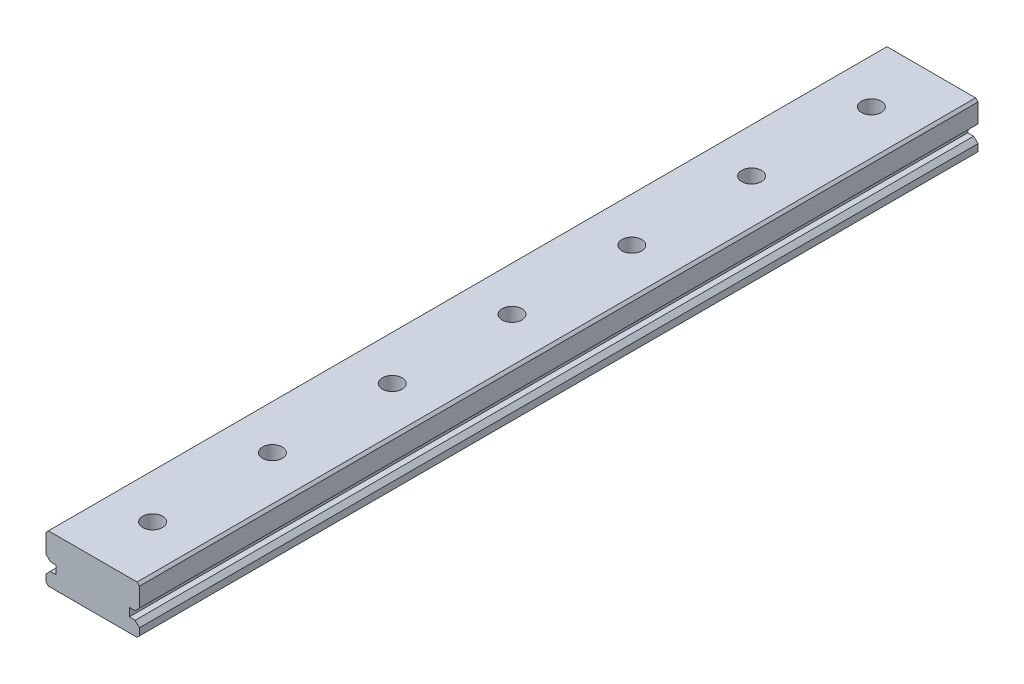
ISO-10303-21;
HEADER;
FILE_DESCRIPTION(('STEP AP214'),'2;1');
FILE_NAME('part.step','',(''),(''),'','','');
FILE_SCHEMA(('AUTOMOTIVE_DESIGN { 1 0 10303 214 1 1 1 1 }'));
ENDSEC;
DATA;
#1=APPLICATION_CONTEXT('core data for automotive mechanical design processes');
#2=APPLICATION_PROTOCOL_DEFINITION('international standard','automotive_design',2000,#1);
#3=PRODUCT_CONTEXT('',#1,'mechanical');
#4=PRODUCT('Part','Part','',(#3));
#5=PRODUCT_RELATED_PRODUCT_CATEGORY('part','',(#4));
#6=PRODUCT_DEFINITION_FORMATION('','',#4);
#7=PRODUCT_DEFINITION_CONTEXT('part definition',#1,'design');
#8=PRODUCT_DEFINITION('design','',#6,#7);
#9=PRODUCT_DEFINITION_SHAPE('','',#8);
#10=(LENGTH_UNIT() NAMED_UNIT(*) SI_UNIT(.MILLI.,.METRE.));
#11=(NAMED_UNIT(*) PLANE_ANGLE_UNIT() SI_UNIT($,.RADIAN.));
#12=(NAMED_UNIT(*) SI_UNIT($,.STERADIAN.) SOLID_ANGLE_UNIT());
#13=UNCERTAINTY_MEASURE_WITH_UNIT(LENGTH_MEASURE(1.E-05),#10,'distance_accuracy_value','');
#14=(GEOMETRIC_REPRESENTATION_CONTEXT(3) GLOBAL_UNCERTAINTY_ASSIGNED_CONTEXT((#13)) GLOBAL_UNIT_ASSIGNED_CONTEXT((#10,
#11,#12)) REPRESENTATION_CONTEXT('',''));
#15=CARTESIAN_POINT('',(0.,0.,0.));
#16=DIRECTION('',(0.,0.,1.));
#17=DIRECTION('',(1.,0.,0.));
#18=AXIS2_PLACEMENT_3D('',#15,#16,#17);
#19=CARTESIAN_POINT('',(7.44000000000001,1.15,70.));
#20=DIRECTION('',(0.,-1.,0.));
#21=DIRECTION('',(1.,0.,0.));
#22=AXIS2_PLACEMENT_3D('',#19,#20,#21);
#23=PLANE('',#22);
#24=DIRECTION('',(0.,0.,1.));
#25=VECTOR('',#24,1.);
#26=CARTESIAN_POINT('',(6.95,1.15,70.));
#27=LINE('',#26,#25);
#28=CARTESIAN_POINT('',(6.95,1.15,0.));
#29=VERTEX_POINT('',#28);
#30=CARTESIAN_POINT('',(6.95,1.15,70.));
#31=VERTEX_POINT('',#30);
#32=EDGE_CURVE('E167',#29,#31,#27,.T.);
#33=ORIENTED_EDGE('',*,*,#32,.T.);
#34=DIRECTION('',(1.,0.,0.));
#35=VECTOR('',#34,1.);
#36=CARTESIAN_POINT('',(7.44000000000001,1.15,70.));
#37=LINE('',#36,#35);
#38=CARTESIAN_POINT('',(7.44000000000001,1.15,70.));
#39=VERTEX_POINT('',#38);
#40=EDGE_CURVE('E155',#39,#31,#37,.F.);
#41=ORIENTED_EDGE('',*,*,#40,.F.);
#42=DIRECTION('',(0.,0.,1.));
#43=VECTOR('',#42,1.);
#44=CARTESIAN_POINT('',(7.44000000000001,1.15,70.));
#45=LINE('',#44,#43);
#46=CARTESIAN_POINT('',(7.44000000000001,1.15,0.));
#47=VERTEX_POINT('',#46);
#48=EDGE_CURVE('E348',#39,#47,#45,.F.);
#49=ORIENTED_EDGE('',*,*,#48,.T.);
#50=DIRECTION('',(1.,0.,0.));
#51=VECTOR('',#50,1.);
#52=CARTESIAN_POINT('',(7.44000000000001,1.15,0.));
#53=LINE('',#52,#51);
#54=EDGE_CURVE('E150',#29,#47,#53,.T.);
#55=ORIENTED_EDGE('',*,*,#54,.F.);
#56=EDGE_LOOP('',(#33,#41,#49,#55));
#57=FACE_BOUND('',#56,.T.);
#58=ADVANCED_FACE('F16',(#57),#23,.F.);
#59=CARTESIAN_POINT('',(0.35999999999999,1.15,70.));
#60=DIRECTION('',(0.,-1.,0.));
#61=DIRECTION('',(1.,0.,0.));
#62=AXIS2_PLACEMENT_3D('',#59,#60,#61);
#63=PLANE('',#62);
#64=DIRECTION('',(0.,0.,1.));
#65=VECTOR('',#64,1.);
#66=CARTESIAN_POINT('',(0.35999999999999,1.15,70.));
#67=LINE('',#66,#65);
#68=CARTESIAN_POINT('',(0.35999999999999,1.15,0.));
#69=VERTEX_POINT('',#68);
#70=CARTESIAN_POINT('',(0.35999999999999,1.15,70.));
#71=VERTEX_POINT('',#70);
#72=EDGE_CURVE('E343',#69,#71,#67,.T.);
#73=ORIENTED_EDGE('',*,*,#72,.T.);
#74=DIRECTION('',(1.,0.,0.));
#75=VECTOR('',#74,1.);
#76=CARTESIAN_POINT('',(0.35999999999999,1.15,70.));
#77=LINE('',#76,#75);
#78=CARTESIAN_POINT('',(0.85,1.15,70.));
#79=VERTEX_POINT('',#78);
#80=EDGE_CURVE('E175',#79,#71,#77,.F.);
#81=ORIENTED_EDGE('',*,*,#80,.F.);
#82=DIRECTION('',(0.,0.,1.));
#83=VECTOR('',#82,1.);
#84=CARTESIAN_POINT('',(0.85,1.15,70.));
#85=LINE('',#84,#83);
#86=CARTESIAN_POINT('',(0.85,1.15,0.));
#87=VERTEX_POINT('',#86);
#88=EDGE_CURVE('E353',#79,#87,#85,.F.);
#89=ORIENTED_EDGE('',*,*,#88,.T.);
#90=DIRECTION('',(1.,0.,0.));
#91=VECTOR('',#90,1.);
#92=CARTESIAN_POINT('',(0.35999999999999,1.15,0.));
#93=LINE('',#92,#91);
#94=EDGE_CURVE('E173',#69,#87,#93,.T.);
#95=ORIENTED_EDGE('',*,*,#94,.F.);
#96=EDGE_LOOP('',(#73,#81,#89,#95));
#97=FACE_BOUND('',#96,.T.);
#98=ADVANCED_FACE('F793',(#97),#63,.F.);
#99=CARTESIAN_POINT('',(6.95,1.85,70.));
#100=DIRECTION('',(-1.,0.,0.));
#101=DIRECTION('',(0.,0.,1.));
#102=AXIS2_PLACEMENT_3D('',#99,#100,#101);
#103=PLANE('',#102);
#104=DIRECTION('',(0.,0.,1.));
#105=VECTOR('',#104,1.);
#106=CARTESIAN_POINT('',(6.95,1.85,70.));
#107=LINE('',#106,#105);
#108=CARTESIAN_POINT('',(6.95,1.85,0.));
#109=VERTEX_POINT('',#108);
#110=CARTESIAN_POINT('',(6.95,1.85,70.));
#111=VERTEX_POINT('',#110);
#112=EDGE_CURVE('E170',#109,#111,#107,.T.);
#113=ORIENTED_EDGE('',*,*,#112,.T.);
#114=DIRECTION('',(0.,1.,0.));
#115=VECTOR('',#114,1.);
#116=CARTESIAN_POINT('',(6.95,1.85,70.));
#117=LINE('',#116,#115);
#118=EDGE_CURVE('E158',#31,#111,#117,.T.);
#119=ORIENTED_EDGE('',*,*,#118,.F.);
#120=ORIENTED_EDGE('',*,*,#32,.F.);
#121=DIRECTION('',(0.,1.,0.));
#122=VECTOR('',#121,1.);
#123=CARTESIAN_POINT('',(6.95,1.85,0.));
#124=LINE('',#123,#122);
#125=EDGE_CURVE('E171',#109,#29,#124,.F.);
#126=ORIENTED_EDGE('',*,*,#125,.F.);
#127=EDGE_LOOP('',(#113,#119,#120,#126));
#128=FACE_BOUND('',#127,.T.);
#129=ADVANCED_FACE('F166',(#128),#103,.F.);
#130=CARTESIAN_POINT('',(0.85,1.85,70.));
#131=DIRECTION('',(1.,0.,0.));
#132=DIRECTION('',(0.,1.,0.));
#133=AXIS2_PLACEMENT_3D('',#130,#131,#132);
#134=PLANE('',#133);
#135=ORIENTED_EDGE('',*,*,#88,.F.);
#136=DIRECTION('',(0.,1.,0.));
#137=VECTOR('',#136,1.);
#138=CARTESIAN_POINT('',(0.85,1.85,70.));
#139=LINE('',#138,#137);
#140=CARTESIAN_POINT('',(0.85,1.85,70.));
#141=VERTEX_POINT('',#140);
#142=EDGE_CURVE('E356',#141,#79,#139,.F.);
#143=ORIENTED_EDGE('',*,*,#142,.F.);
#144=DIRECTION('',(0.,0.,1.));
#145=VECTOR('',#144,1.);
#146=CARTESIAN_POINT('',(0.85,1.85,70.));
#147=LINE('',#146,#145);
#148=CARTESIAN_POINT('',(0.85,1.85,0.));
#149=VERTEX_POINT('',#148);
#150=EDGE_CURVE('E326',#141,#149,#147,.F.);
#151=ORIENTED_EDGE('',*,*,#150,.T.);
#152=DIRECTION('',(0.,1.,0.));
#153=VECTOR('',#152,1.);
#154=CARTESIAN_POINT('',(0.85,1.85,0.));
#155=LINE('',#154,#153);
#156=EDGE_CURVE('E351',#87,#149,#155,.T.);
#157=ORIENTED_EDGE('',*,*,#156,.F.);
#158=EDGE_LOOP('',(#135,#143,#151,#157));
#159=FACE_BOUND('',#158,.T.);
#160=ADVANCED_FACE('F776',(#159),#134,.F.);
#161=CARTESIAN_POINT('',(7.44000000000001,1.15,70.));
#162=DIRECTION('',(-0.707106781186544,-0.707106781186551,0.));
#163=DIRECTION('',(0.707106781186551,-0.707106781186544,0.));
#164=AXIS2_PLACEMENT_3D('',#161,#162,#163);
#165=PLANE('',#164);
#166=ORIENTED_EDGE('',*,*,#48,.F.);
#167=DIRECTION('',(0.707106781186551,-0.707106781186544,0.));
#168=VECTOR('',#167,1.);
#169=CARTESIAN_POINT('',(7.44000000000001,1.15,70.));
#170=LINE('',#169,#168);
#171=CARTESIAN_POINT('',(7.8,0.790000000000014,70.));
#172=VERTEX_POINT('',#171);
#173=EDGE_CURVE('E161',#172,#39,#170,.F.);
#174=ORIENTED_EDGE('',*,*,#173,.F.);
#175=DIRECTION('',(0.,0.,1.));
#176=VECTOR('',#175,1.);
#177=CARTESIAN_POINT('',(7.8,0.790000000000014,70.));
#178=LINE('',#177,#176);
#179=CARTESIAN_POINT('',(7.8,0.790000000000014,0.));
#180=VERTEX_POINT('',#179);
#181=EDGE_CURVE('E321',#172,#180,#178,.F.);
#182=ORIENTED_EDGE('',*,*,#181,.T.);
#183=DIRECTION('',(0.707106781186551,-0.707106781186544,0.));
#184=VECTOR('',#183,1.);
#185=CARTESIAN_POINT('',(7.44000000000001,1.15,0.));
#186=LINE('',#185,#184);
#187=EDGE_CURVE('E346',#47,#180,#186,.T.);
#188=ORIENTED_EDGE('',*,*,#187,.F.);
#189=EDGE_LOOP('',(#166,#174,#182,#188));
#190=FACE_BOUND('',#189,.T.);
#191=ADVANCED_FACE('F767',(#190),#165,.F.);
#192=CARTESIAN_POINT('',(0.35999999999999,1.15,70.));
#193=DIRECTION('',(0.707106781186543,-0.707106781186552,0.));
#194=DIRECTION('',(0.707106781186552,0.707106781186543,0.));
#195=AXIS2_PLACEMENT_3D('',#192,#193,#194);
#196=PLANE('',#195);
#197=DIRECTION('',(0.,0.,1.));
#198=VECTOR('',#197,1.);
#199=CARTESIAN_POINT('',(0.,0.790000000000012,70.));
#200=LINE('',#199,#198);
#201=CARTESIAN_POINT('',(0.,0.790000000000013,0.));
#202=VERTEX_POINT('',#201);
#203=CARTESIAN_POINT('',(0.,0.790000000000013,70.));
#204=VERTEX_POINT('',#203);
#205=EDGE_CURVE('E314',#202,#204,#200,.T.);
#206=ORIENTED_EDGE('',*,*,#205,.T.);
#207=DIRECTION('',(0.707106781186552,0.707106781186543,0.));
#208=VECTOR('',#207,1.);
#209=CARTESIAN_POINT('',(0.35999999999999,1.15,70.));
#210=LINE('',#209,#208);
#211=EDGE_CURVE('E341',#71,#204,#210,.F.);
#212=ORIENTED_EDGE('',*,*,#211,.F.);
#213=ORIENTED_EDGE('',*,*,#72,.F.);
#214=DIRECTION('',(0.707106781186552,0.707106781186543,0.));
#215=VECTOR('',#214,1.);
#216=CARTESIAN_POINT('',(0.35999999999999,1.15,0.));
#217=LINE('',#216,#215);
#218=EDGE_CURVE('E338',#202,#69,#217,.T.);
#219=ORIENTED_EDGE('',*,*,#218,.F.);
#220=EDGE_LOOP('',(#206,#212,#213,#219));
#221=FACE_BOUND('',#220,.T.);
#222=ADVANCED_FACE('F759',(#221),#196,.F.);
#223=CARTESIAN_POINT('',(7.44,1.85,70.));
#224=DIRECTION('',(0.,1.,0.));
#225=DIRECTION('',(-1.,0.,0.));
#226=AXIS2_PLACEMENT_3D('',#223,#224,#225);
#227=PLANE('',#226);
#228=DIRECTION('',(0.,0.,1.));
#229=VECTOR('',#228,1.);
#230=CARTESIAN_POINT('',(7.44,1.85,70.));
#231=LINE('',#230,#229);
#232=CARTESIAN_POINT('',(7.44,1.85,0.));
#233=VERTEX_POINT('',#232);
#234=CARTESIAN_POINT('',(7.44,1.85,70.));
#235=VERTEX_POINT('',#234);
#236=EDGE_CURVE('E306',#233,#235,#231,.T.);
#237=ORIENTED_EDGE('',*,*,#236,.T.);
#238=DIRECTION('',(-1.,0.,0.));
#239=VECTOR('',#238,1.);
#240=CARTESIAN_POINT('',(7.44,1.85,70.));
#241=LINE('',#240,#239);
#242=EDGE_CURVE('E335',#111,#235,#241,.F.);
#243=ORIENTED_EDGE('',*,*,#242,.F.);
#244=ORIENTED_EDGE('',*,*,#112,.F.);
#245=DIRECTION('',(-1.,0.,0.));
#246=VECTOR('',#245,1.);
#247=CARTESIAN_POINT('',(7.44,1.85,0.));
#248=LINE('',#247,#246);
#249=EDGE_CURVE('E332',#233,#109,#248,.T.);
#250=ORIENTED_EDGE('',*,*,#249,.F.);
#251=EDGE_LOOP('',(#237,#243,#244,#250));
#252=FACE_BOUND('',#251,.T.);
#253=ADVANCED_FACE('F361',(#252),#227,.F.);
#254=CARTESIAN_POINT('',(0.359999999999996,1.85,70.));
#255=DIRECTION('',(0.,1.,0.));
#256=DIRECTION('',(-1.,0.,0.));
#257=AXIS2_PLACEMENT_3D('',#254,#255,#256);
#258=PLANE('',#257);
#259=ORIENTED_EDGE('',*,*,#150,.F.);
#260=DIRECTION('',(-1.,0.,0.));
#261=VECTOR('',#260,1.);
#262=CARTESIAN_POINT('',(0.359999999999996,1.85,70.));
#263=LINE('',#262,#261);
#264=CARTESIAN_POINT('',(0.359999999999995,1.85,70.));
#265=VERTEX_POINT('',#264);
#266=EDGE_CURVE('E329',#265,#141,#263,.F.);
#267=ORIENTED_EDGE('',*,*,#266,.F.);
#268=DIRECTION('',(0.,0.,1.));
#269=VECTOR('',#268,1.);
#270=CARTESIAN_POINT('',(0.359999999999996,1.85,70.));
#271=LINE('',#270,#269);
#272=CARTESIAN_POINT('',(0.359999999999996,1.85,0.));
#273=VERTEX_POINT('',#272);
#274=EDGE_CURVE('E295',#265,#273,#271,.F.);
#275=ORIENTED_EDGE('',*,*,#274,.T.);
#276=DIRECTION('',(-1.,0.,0.));
#277=VECTOR('',#276,1.);
#278=CARTESIAN_POINT('',(0.359999999999996,1.85,0.));
#279=LINE('',#278,#277);
#280=EDGE_CURVE('E324',#149,#273,#279,.T.);
#281=ORIENTED_EDGE('',*,*,#280,.F.);
#282=EDGE_LOOP('',(#259,#267,#275,#281));
#283=FACE_BOUND('',#282,.T.);
#284=ADVANCED_FACE('F742',(#283),#258,.F.);
#285=CARTESIAN_POINT('',(7.8,0.,70.));
#286=DIRECTION('',(-1.,0.,0.));
#287=DIRECTION('',(0.,-1.,0.));
#288=AXIS2_PLACEMENT_3D('',#285,#286,#287);
#289=PLANE('',#288);
#290=DIRECTION('',(0.,0.,1.));
#291=VECTOR('',#290,1.);
#292=CARTESIAN_POINT('',(7.8,0.199999999999999,70.));
#293=LINE('',#292,#291);
#294=CARTESIAN_POINT('',(7.8,0.2,70.));
#295=VERTEX_POINT('',#294);
#296=CARTESIAN_POINT('',(7.8,0.2,0.));
#297=VERTEX_POINT('',#296);
#298=EDGE_CURVE('E290',#295,#297,#293,.F.);
#299=ORIENTED_EDGE('',*,*,#298,.T.);
#300=DIRECTION('',(0.,-1.,0.));
#301=VECTOR('',#300,1.);
#302=CARTESIAN_POINT('',(7.8,0.,0.));
#303=LINE('',#302,#301);
#304=EDGE_CURVE('E319',#180,#297,#303,.T.);
#305=ORIENTED_EDGE('',*,*,#304,.F.);
#306=ORIENTED_EDGE('',*,*,#181,.F.);
#307=DIRECTION('',(0.,-1.,0.));
#308=VECTOR('',#307,1.);
#309=CARTESIAN_POINT('',(7.8,0.,70.));
#310=LINE('',#309,#308);
#311=EDGE_CURVE('E317',#295,#172,#310,.F.);
#312=ORIENTED_EDGE('',*,*,#311,.F.);
#313=EDGE_LOOP('',(#299,#305,#306,#312));
#314=FACE_BOUND('',#313,.T.);
#315=ADVANCED_FACE('F733',(#314),#289,.F.);
#316=CARTESIAN_POINT('',(0.,0.,70.));
#317=DIRECTION('',(1.,0.,0.));
#318=DIRECTION('',(0.,1.,0.));
#319=AXIS2_PLACEMENT_3D('',#316,#317,#318);
#320=PLANE('',#319);
#321=DIRECTION('',(0.,0.,1.));
#322=VECTOR('',#321,1.);
#323=CARTESIAN_POINT('',(0.,0.199999999999999,70.));
#324=LINE('',#323,#322);
#325=CARTESIAN_POINT('',(0.,0.199999999999999,0.));
#326=VERTEX_POINT('',#325);
#327=CARTESIAN_POINT('',(0.,0.199999999999999,70.));
#328=VERTEX_POINT('',#327);
#329=EDGE_CURVE('E273',#326,#328,#324,.T.);
#330=ORIENTED_EDGE('',*,*,#329,.T.);
#331=DIRECTION('',(0.,1.,0.));
#332=VECTOR('',#331,1.);
#333=CARTESIAN_POINT('',(0.,0.,70.));
#334=LINE('',#333,#332);
#335=EDGE_CURVE('E312',#204,#328,#334,.F.);
#336=ORIENTED_EDGE('',*,*,#335,.F.);
#337=ORIENTED_EDGE('',*,*,#205,.F.);
#338=DIRECTION('',(0.,1.,0.));
#339=VECTOR('',#338,1.);
#340=CARTESIAN_POINT('',(0.,0.,0.));
#341=LINE('',#340,#339);
#342=EDGE_CURVE('E309',#326,#202,#341,.T.);
#343=ORIENTED_EDGE('',*,*,#342,.F.);
#344=EDGE_LOOP('',(#330,#336,#337,#343));
#345=FACE_BOUND('',#344,.T.);
#346=ADVANCED_FACE('F725',(#345),#320,.F.);
#347=CARTESIAN_POINT('',(7.8,2.21,70.));
#348=DIRECTION('',(-0.707106781186551,0.707106781186544,0.));
#349=DIRECTION('',(-0.707106781186544,-0.707106781186551,0.));
#350=AXIS2_PLACEMENT_3D('',#347,#348,#349);
#351=PLANE('',#350);
#352=DIRECTION('',(0.,0.,1.));
#353=VECTOR('',#352,1.);
#354=CARTESIAN_POINT('',(7.8,2.21,70.));
#355=LINE('',#354,#353);
#356=CARTESIAN_POINT('',(7.8,2.21,0.));
#357=VERTEX_POINT('',#356);
#358=CARTESIAN_POINT('',(7.8,2.21,70.));
#359=VERTEX_POINT('',#358);
#360=EDGE_CURVE('E263',#357,#359,#355,.T.);
#361=ORIENTED_EDGE('',*,*,#360,.T.);
#362=DIRECTION('',(-0.707106781186544,-0.707106781186551,0.));
#363=VECTOR('',#362,1.);
#364=CARTESIAN_POINT('',(7.8,2.21,70.));
#365=LINE('',#364,#363);
#366=EDGE_CURVE('E304',#235,#359,#365,.F.);
#367=ORIENTED_EDGE('',*,*,#366,.F.);
#368=ORIENTED_EDGE('',*,*,#236,.F.);
#369=DIRECTION('',(-0.707106781186544,-0.707106781186551,0.));
#370=VECTOR('',#369,1.);
#371=CARTESIAN_POINT('',(7.8,2.21,0.));
#372=LINE('',#371,#370);
#373=EDGE_CURVE('E301',#357,#233,#372,.T.);
#374=ORIENTED_EDGE('',*,*,#373,.F.);
#375=EDGE_LOOP('',(#361,#367,#368,#374));
#376=FACE_BOUND('',#375,.T.);
#377=ADVANCED_FACE('F366',(#376),#351,.F.);
#378=CARTESIAN_POINT('',(0.,2.21,70.));
#379=DIRECTION('',(0.707106781186551,0.707106781186544,0.));
#380=DIRECTION('',(-0.707106781186544,0.707106781186551,0.));
#381=AXIS2_PLACEMENT_3D('',#378,#379,#380);
#382=PLANE('',#381);
#383=ORIENTED_EDGE('',*,*,#274,.F.);
#384=DIRECTION('',(-0.707106781186544,0.707106781186551,0.));
#385=VECTOR('',#384,1.);
#386=CARTESIAN_POINT('',(0.,2.21,70.));
#387=LINE('',#386,#385);
#388=CARTESIAN_POINT('',(0.,2.21,70.));
#389=VERTEX_POINT('',#388);
#390=EDGE_CURVE('E298',#389,#265,#387,.F.);
#391=ORIENTED_EDGE('',*,*,#390,.F.);
#392=DIRECTION('',(0.,0.,1.));
#393=VECTOR('',#392,1.);
#394=CARTESIAN_POINT('',(0.,2.21,70.));
#395=LINE('',#394,#393);
#396=CARTESIAN_POINT('',(0.,2.21,0.));
#397=VERTEX_POINT('',#396);
#398=EDGE_CURVE('E376',#389,#397,#395,.F.);
#399=ORIENTED_EDGE('',*,*,#398,.T.);
#400=DIRECTION('',(-0.707106781186544,0.707106781186551,0.));
#401=VECTOR('',#400,1.);
#402=CARTESIAN_POINT('',(0.,2.21,0.));
#403=LINE('',#402,#401);
#404=EDGE_CURVE('E293',#273,#397,#403,.T.);
#405=ORIENTED_EDGE('',*,*,#404,.F.);
#406=EDGE_LOOP('',(#383,#391,#399,#405));
#407=FACE_BOUND('',#406,.T.);
#408=ADVANCED_FACE('F709',(#407),#382,.F.);
#409=CARTESIAN_POINT('',(3.9,0.,55.));
#410=DIRECTION('',(0.,-1.,0.));
#411=DIRECTION('',(0.,0.,-1.));
#412=AXIS2_PLACEMENT_3D('',#409,#410,#411);
#413=CYLINDRICAL_SURFACE('',#412,1.8);
#414=CARTESIAN_POINT('',(3.9,1.6,55.));
#415=DIRECTION('',(0.,-1.,0.));
#416=DIRECTION('',(0.,0.,-1.));
#417=AXIS2_PLACEMENT_3D('',#414,#415,#416);
#418=CIRCLE('',#417,1.8);
#419=CARTESIAN_POINT('',(3.9,1.6,53.2));
#420=VERTEX_POINT('',#419);
#421=EDGE_CURVE('E19',#420,#420,#418,.F.);
#422=ORIENTED_EDGE('',*,*,#421,.T.);
#423=EDGE_LOOP('',(#422));
#424=FACE_BOUND('',#423,.T.);
#425=CARTESIAN_POINT('',(3.9,0.,55.));
#426=DIRECTION('',(0.,-1.,0.));
#427=DIRECTION('',(0.,0.,-1.));
#428=AXIS2_PLACEMENT_3D('',#425,#426,#427);
#429=CIRCLE('',#428,1.8);
#430=CARTESIAN_POINT('',(3.9,0.,53.2));
#431=VERTEX_POINT('',#430);
#432=EDGE_CURVE('E258',#431,#431,#429,.T.);
#433=ORIENTED_EDGE('',*,*,#432,.T.);
#434=EDGE_LOOP('',(#433));
#435=FACE_BOUND('',#434,.T.);
#436=ADVANCED_FACE('F701',(#424,#435),#413,.F.);
#437=CARTESIAN_POINT('',(3.9,0.,65.));
#438=DIRECTION('',(0.,-1.,0.));
#439=DIRECTION('',(0.,0.,-1.));
#440=AXIS2_PLACEMENT_3D('',#437,#438,#439);
#441=CYLINDRICAL_SURFACE('',#440,1.8);
#442=CARTESIAN_POINT('',(3.9,1.6,65.));
#443=DIRECTION('',(0.,-1.,0.));
#444=DIRECTION('',(0.,0.,-1.));
#445=AXIS2_PLACEMENT_3D('',#442,#443,#444);
#446=CIRCLE('',#445,1.8);
#447=CARTESIAN_POINT('',(3.9,1.6,63.2));
#448=VERTEX_POINT('',#447);
#449=EDGE_CURVE('E261',#448,#448,#446,.F.);
#450=ORIENTED_EDGE('',*,*,#449,.T.);
#451=EDGE_LOOP('',(#450));
#452=FACE_BOUND('',#451,.T.);
#453=CARTESIAN_POINT('',(3.9,0.,65.));
#454=DIRECTION('',(0.,-1.,0.));
#455=DIRECTION('',(0.,0.,-1.));
#456=AXIS2_PLACEMENT_3D('',#453,#454,#455);
#457=CIRCLE('',#456,1.8);
#458=CARTESIAN_POINT('',(3.9,0.,63.2));
#459=VERTEX_POINT('',#458);
#460=EDGE_CURVE('E254',#459,#459,#457,.T.);
#461=ORIENTED_EDGE('',*,*,#460,.T.);
#462=EDGE_LOOP('',(#461));
#463=FACE_BOUND('',#462,.T.);
#464=ADVANCED_FACE('F692',(#452,#463),#441,.F.);
#465=CARTESIAN_POINT('',(7.8,0.199999999999999,70.));
#466=DIRECTION('',(-0.707106781186548,0.707106781186548,0.));
#467=DIRECTION('',(-0.707106781186548,-0.707106781186548,0.));
#468=AXIS2_PLACEMENT_3D('',#465,#466,#467);
#469=PLANE('',#468);
#470=DIRECTION('',(0.,0.,1.));
#471=VECTOR('',#470,1.);
#472=CARTESIAN_POINT('',(7.6,0.,70.));
#473=LINE('',#472,#471);
#474=CARTESIAN_POINT('',(7.6,0.,70.));
#475=VERTEX_POINT('',#474);
#476=CARTESIAN_POINT('',(7.6,0.,0.));
#477=VERTEX_POINT('',#476);
#478=EDGE_CURVE('E257',#475,#477,#473,.F.);
#479=ORIENTED_EDGE('',*,*,#478,.T.);
#480=DIRECTION('',(-0.707106781186548,-0.707106781186548,0.));
#481=VECTOR('',#480,1.);
#482=CARTESIAN_POINT('',(7.8,0.199999999999999,0.));
#483=LINE('',#482,#481);
#484=EDGE_CURVE('E288',#297,#477,#483,.T.);
#485=ORIENTED_EDGE('',*,*,#484,.F.);
#486=ORIENTED_EDGE('',*,*,#298,.F.);
#487=DIRECTION('',(-0.707106781186548,-0.707106781186548,0.));
#488=VECTOR('',#487,1.);
#489=CARTESIAN_POINT('',(7.8,0.199999999999999,70.));
#490=LINE('',#489,#488);
#491=EDGE_CURVE('E285',#475,#295,#490,.F.);
#492=ORIENTED_EDGE('',*,*,#491,.F.);
#493=EDGE_LOOP('',(#479,#485,#486,#492));
#494=FACE_BOUND('',#493,.T.);
#495=ADVANCED_FACE('F683',(#494),#469,.F.);
#496=CARTESIAN_POINT('',(0.199999999999999,0.,70.));
#497=DIRECTION('',(0.707106781186548,0.707106781186548,0.));
#498=DIRECTION('',(-0.707106781186548,0.707106781186548,0.));
#499=AXIS2_PLACEMENT_3D('',#496,#497,#498);
#500=PLANE('',#499);
#501=ORIENTED_EDGE('',*,*,#329,.F.);
#502=DIRECTION('',(-0.707106781186548,0.707106781186548,0.));
#503=VECTOR('',#502,1.);
#504=CARTESIAN_POINT('',(0.199999999999999,0.,0.));
#505=LINE('',#504,#503);
#506=CARTESIAN_POINT('',(0.199999999999999,0.,0.));
#507=VERTEX_POINT('',#506);
#508=EDGE_CURVE('E279',#507,#326,#505,.T.);
#509=ORIENTED_EDGE('',*,*,#508,.F.);
#510=DIRECTION('',(0.,0.,1.));
#511=VECTOR('',#510,1.);
#512=CARTESIAN_POINT('',(0.199999999999999,0.,70.));
#513=LINE('',#512,#511);
#514=CARTESIAN_POINT('',(0.199999999999999,0.,70.));
#515=VERTEX_POINT('',#514);
#516=EDGE_CURVE('E253',#507,#515,#513,.T.);
#517=ORIENTED_EDGE('',*,*,#516,.T.);
#518=DIRECTION('',(-0.707106781186548,0.707106781186548,0.));
#519=VECTOR('',#518,1.);
#520=CARTESIAN_POINT('',(0.199999999999999,0.,70.));
#521=LINE('',#520,#519);
#522=EDGE_CURVE('E270',#328,#515,#521,.F.);
#523=ORIENTED_EDGE('',*,*,#522,.F.);
#524=EDGE_LOOP('',(#501,#509,#517,#523));
#525=FACE_BOUND('',#524,.T.);
#526=ADVANCED_FACE('F674',(#525),#500,.F.);
#527=CARTESIAN_POINT('',(3.9,0.,45.));
#528=DIRECTION('',(0.,-1.,0.));
#529=DIRECTION('',(0.,0.,-1.));
#530=AXIS2_PLACEMENT_3D('',#527,#528,#529);
#531=CYLINDRICAL_SURFACE('',#530,1.8);
#532=CARTESIAN_POINT('',(3.9,1.6,45.));
#533=DIRECTION('',(0.,-1.,0.));
#534=DIRECTION('',(0.,0.,-1.));
#535=AXIS2_PLACEMENT_3D('',#532,#533,#534);
#536=CIRCLE('',#535,1.8);
#537=CARTESIAN_POINT('',(3.9,1.6,43.2));
#538=VERTEX_POINT('',#537);
#539=EDGE_CURVE('E235',#538,#538,#536,.F.);
#540=ORIENTED_EDGE('',*,*,#539,.T.);
#541=EDGE_LOOP('',(#540));
#542=FACE_BOUND('',#541,.T.);
#543=CARTESIAN_POINT('',(3.9,0.,45.));
#544=DIRECTION('',(0.,-1.,0.));
#545=DIRECTION('',(0.,0.,-1.));
#546=AXIS2_PLACEMENT_3D('',#543,#544,#545);
#547=CIRCLE('',#546,1.8);
#548=CARTESIAN_POINT('',(3.9,0.,43.2));
#549=VERTEX_POINT('',#548);
#550=EDGE_CURVE('E250',#549,#549,#547,.T.);
#551=ORIENTED_EDGE('',*,*,#550,.T.);
#552=EDGE_LOOP('',(#551));
#553=FACE_BOUND('',#552,.T.);
#554=ADVANCED_FACE('F665',(#542,#553),#531,.F.);
#555=CARTESIAN_POINT('',(3.9,0.,35.));
#556=DIRECTION('',(0.,-1.,0.));
#557=DIRECTION('',(0.,0.,-1.));
#558=AXIS2_PLACEMENT_3D('',#555,#556,#557);
#559=CYLINDRICAL_SURFACE('',#558,1.8);
#560=CARTESIAN_POINT('',(3.9,1.6,35.));
#561=DIRECTION('',(0.,-1.,0.));
#562=DIRECTION('',(0.,0.,-1.));
#563=AXIS2_PLACEMENT_3D('',#560,#561,#562);
#564=CIRCLE('',#563,1.8);
#565=CARTESIAN_POINT('',(3.9,1.6,33.2));
#566=VERTEX_POINT('',#565);
#567=EDGE_CURVE('E232',#566,#566,#564,.F.);
#568=ORIENTED_EDGE('',*,*,#567,.T.);
#569=EDGE_LOOP('',(#568));
#570=FACE_BOUND('',#569,.T.);
#571=CARTESIAN_POINT('',(3.9,0.,35.));
#572=DIRECTION('',(0.,-1.,0.));
#573=DIRECTION('',(0.,0.,-1.));
#574=AXIS2_PLACEMENT_3D('',#571,#572,#573);
#575=CIRCLE('',#574,1.8);
#576=CARTESIAN_POINT('',(3.9,0.,33.2));
#577=VERTEX_POINT('',#576);
#578=EDGE_CURVE('E247',#577,#577,#575,.T.);
#579=ORIENTED_EDGE('',*,*,#578,.T.);
#580=EDGE_LOOP('',(#579));
#581=FACE_BOUND('',#580,.T.);
#582=ADVANCED_FACE('F656',(#570,#581),#559,.F.);
#583=CARTESIAN_POINT('',(3.9,0.,25.));
#584=DIRECTION('',(0.,-1.,0.));
#585=DIRECTION('',(0.,0.,-1.));
#586=AXIS2_PLACEMENT_3D('',#583,#584,#585);
#587=CYLINDRICAL_SURFACE('',#586,1.8);
#588=CARTESIAN_POINT('',(3.9,1.6,25.));
#589=DIRECTION('',(0.,-1.,0.));
#590=DIRECTION('',(0.,0.,-1.));
#591=AXIS2_PLACEMENT_3D('',#588,#589,#590);
#592=CIRCLE('',#591,1.8);
#593=CARTESIAN_POINT('',(3.9,1.6,23.2));
#594=VERTEX_POINT('',#593);
#595=EDGE_CURVE('E229',#594,#594,#592,.F.);
#596=ORIENTED_EDGE('',*,*,#595,.T.);
#597=EDGE_LOOP('',(#596));
#598=FACE_BOUND('',#597,.T.);
#599=CARTESIAN_POINT('',(3.9,0.,25.));
#600=DIRECTION('',(0.,-1.,0.));
#601=DIRECTION('',(0.,0.,-1.));
#602=AXIS2_PLACEMENT_3D('',#599,#600,#601);
#603=CIRCLE('',#602,1.8);
#604=CARTESIAN_POINT('',(3.9,0.,23.2));
#605=VERTEX_POINT('',#604);
#606=EDGE_CURVE('E244',#605,#605,#603,.T.);
#607=ORIENTED_EDGE('',*,*,#606,.T.);
#608=EDGE_LOOP('',(#607));
#609=FACE_BOUND('',#608,.T.);
#610=ADVANCED_FACE('F647',(#598,#609),#587,.F.);
#611=CARTESIAN_POINT('',(3.9,0.,15.));
#612=DIRECTION('',(0.,-1.,0.));
#613=DIRECTION('',(0.,0.,-1.));
#614=AXIS2_PLACEMENT_3D('',#611,#612,#613);
#615=CYLINDRICAL_SURFACE('',#614,1.8);
#616=CARTESIAN_POINT('',(3.9,1.6,15.));
#617=DIRECTION('',(0.,-1.,0.));
#618=DIRECTION('',(0.,0.,-1.));
#619=AXIS2_PLACEMENT_3D('',#616,#617,#618);
#620=CIRCLE('',#619,1.8);
#621=CARTESIAN_POINT('',(3.9,1.6,13.2));
#622=VERTEX_POINT('',#621);
#623=EDGE_CURVE('E226',#622,#622,#620,.F.);
#624=ORIENTED_EDGE('',*,*,#623,.T.);
#625=EDGE_LOOP('',(#624));
#626=FACE_BOUND('',#625,.T.);
#627=CARTESIAN_POINT('',(3.9,0.,15.));
#628=DIRECTION('',(0.,-1.,0.));
#629=DIRECTION('',(0.,0.,-1.));
#630=AXIS2_PLACEMENT_3D('',#627,#628,#629);
#631=CIRCLE('',#630,1.8);
#632=CARTESIAN_POINT('',(3.9,0.,13.2));
#633=VERTEX_POINT('',#632);
#634=EDGE_CURVE('E241',#633,#633,#631,.T.);
#635=ORIENTED_EDGE('',*,*,#634,.T.);
#636=EDGE_LOOP('',(#635));
#637=FACE_BOUND('',#636,.T.);
#638=ADVANCED_FACE('F638',(#626,#637),#615,.F.);
#639=CARTESIAN_POINT('',(3.9,0.,5.));
#640=DIRECTION('',(0.,-1.,0.));
#641=DIRECTION('',(0.,0.,-1.));
#642=AXIS2_PLACEMENT_3D('',#639,#640,#641);
#643=CYLINDRICAL_SURFACE('',#642,1.8);
#644=CARTESIAN_POINT('',(3.9,1.6,5.));
#645=DIRECTION('',(0.,-1.,0.));
#646=DIRECTION('',(0.,0.,-1.));
#647=AXIS2_PLACEMENT_3D('',#644,#645,#646);
#648=CIRCLE('',#647,1.8);
#649=CARTESIAN_POINT('',(3.9,1.6,3.2));
#650=VERTEX_POINT('',#649);
#651=EDGE_CURVE('E223',#650,#650,#648,.F.);
#652=ORIENTED_EDGE('',*,*,#651,.T.);
#653=EDGE_LOOP('',(#652));
#654=FACE_BOUND('',#653,.T.);
#655=CARTESIAN_POINT('',(3.9,0.,5.));
#656=DIRECTION('',(0.,-1.,0.));
#657=DIRECTION('',(0.,0.,-1.));
#658=AXIS2_PLACEMENT_3D('',#655,#656,#657);
#659=CIRCLE('',#658,1.8);
#660=CARTESIAN_POINT('',(3.9,0.,3.2));
#661=VERTEX_POINT('',#660);
#662=EDGE_CURVE('E238',#661,#661,#659,.T.);
#663=ORIENTED_EDGE('',*,*,#662,.T.);
#664=EDGE_LOOP('',(#663));
#665=FACE_BOUND('',#664,.T.);
#666=ADVANCED_FACE('F629',(#654,#665),#643,.F.);
#667=CARTESIAN_POINT('',(4.725,1.6,55.));
#668=DIRECTION('',(0.,1.,0.));
#669=DIRECTION('',(0.,0.,1.));
#670=AXIS2_PLACEMENT_3D('',#667,#668,#669);
#671=PLANE('',#670);
#672=ORIENTED_EDGE('',*,*,#421,.F.);
#673=EDGE_LOOP('',(#672));
#674=FACE_BOUND('',#673,.T.);
#675=CARTESIAN_POINT('',(3.9,1.6,55.));
#676=DIRECTION('',(0.,-1.,0.));
#677=DIRECTION('',(0.,0.,-1.));
#678=AXIS2_PLACEMENT_3D('',#675,#676,#677);
#679=CIRCLE('',#678,0.824999999999999);
#680=CARTESIAN_POINT('',(3.9,1.6,54.175));
#681=VERTEX_POINT('',#680);
#682=EDGE_CURVE('E220',#681,#681,#679,.F.);
#683=ORIENTED_EDGE('',*,*,#682,.T.);
#684=EDGE_LOOP('',(#683));
#685=FACE_BOUND('',#684,.T.);
#686=ADVANCED_FACE('F620',(#674,#685),#671,.F.);
#687=CARTESIAN_POINT('',(4.725,1.6,65.));
#688=DIRECTION('',(0.,1.,0.));
#689=DIRECTION('',(0.,0.,1.));
#690=AXIS2_PLACEMENT_3D('',#687,#688,#689);
#691=PLANE('',#690);
#692=ORIENTED_EDGE('',*,*,#449,.F.);
#693=EDGE_LOOP('',(#692));
#694=FACE_BOUND('',#693,.T.);
#695=CARTESIAN_POINT('',(3.9,1.6,65.));
#696=DIRECTION('',(0.,-1.,0.));
#697=DIRECTION('',(0.,0.,-1.));
#698=AXIS2_PLACEMENT_3D('',#695,#696,#697);
#699=CIRCLE('',#698,0.824999999999992);
#700=CARTESIAN_POINT('',(3.9,1.6,64.175));
#701=VERTEX_POINT('',#700);
#702=EDGE_CURVE('E216',#701,#701,#699,.F.);
#703=ORIENTED_EDGE('',*,*,#702,.T.);
#704=EDGE_LOOP('',(#703));
#705=FACE_BOUND('',#704,.T.);
#706=ADVANCED_FACE('F612',(#694,#705),#691,.F.);
#707=CARTESIAN_POINT('',(7.8,2.21,70.));
#708=DIRECTION('',(-1.,0.,0.));
#709=DIRECTION('',(0.,0.,1.));
#710=AXIS2_PLACEMENT_3D('',#707,#708,#709);
#711=PLANE('',#710);
#712=DIRECTION('',(0.,0.,1.));
#713=VECTOR('',#712,1.);
#714=CARTESIAN_POINT('',(7.8,3.8,70.));
#715=LINE('',#714,#713);
#716=CARTESIAN_POINT('',(7.8,3.8,0.));
#717=VERTEX_POINT('',#716);
#718=CARTESIAN_POINT('',(7.8,3.8,70.));
#719=VERTEX_POINT('',#718);
#720=EDGE_CURVE('E219',#717,#719,#715,.T.);
#721=ORIENTED_EDGE('',*,*,#720,.T.);
#722=DIRECTION('',(0.,1.,0.));
#723=VECTOR('',#722,1.);
#724=CARTESIAN_POINT('',(7.8,2.21,70.));
#725=LINE('',#724,#723);
#726=EDGE_CURVE('E267',#359,#719,#725,.T.);
#727=ORIENTED_EDGE('',*,*,#726,.F.);
#728=ORIENTED_EDGE('',*,*,#360,.F.);
#729=DIRECTION('',(0.,1.,0.));
#730=VECTOR('',#729,1.);
#731=CARTESIAN_POINT('',(7.8,2.21,0.));
#732=LINE('',#731,#730);
#733=EDGE_CURVE('E372',#717,#357,#732,.F.);
#734=ORIENTED_EDGE('',*,*,#733,.F.);
#735=EDGE_LOOP('',(#721,#727,#728,#734));
#736=FACE_BOUND('',#735,.T.);
#737=ADVANCED_FACE('F371',(#736),#711,.F.);
#738=CARTESIAN_POINT('',(0.,2.21,70.));
#739=DIRECTION('',(1.,0.,0.));
#740=DIRECTION('',(0.,1.,0.));
#741=AXIS2_PLACEMENT_3D('',#738,#739,#740);
#742=PLANE('',#741);
#743=DIRECTION('',(0.,0.,1.));
#744=VECTOR('',#743,1.);
#745=CARTESIAN_POINT('',(0.,3.8,70.));
#746=LINE('',#745,#744);
#747=CARTESIAN_POINT('',(0.,3.8,70.));
#748=VERTEX_POINT('',#747);
#749=CARTESIAN_POINT('',(0.,3.8,0.));
#750=VERTEX_POINT('',#749);
#751=EDGE_CURVE('E395',#748,#750,#746,.F.);
#752=ORIENTED_EDGE('',*,*,#751,.T.);
#753=DIRECTION('',(0.,1.,0.));
#754=VECTOR('',#753,1.);
#755=CARTESIAN_POINT('',(0.,2.21,0.));
#756=LINE('',#755,#754);
#757=EDGE_CURVE('E260',#397,#750,#756,.T.);
#758=ORIENTED_EDGE('',*,*,#757,.F.);
#759=ORIENTED_EDGE('',*,*,#398,.F.);
#760=DIRECTION('',(0.,1.,0.));
#761=VECTOR('',#760,1.);
#762=CARTESIAN_POINT('',(0.,0.,70.));
#763=LINE('',#762,#761);
#764=EDGE_CURVE('E386',#389,#748,#763,.T.);
#765=ORIENTED_EDGE('',*,*,#764,.T.);
#766=EDGE_LOOP('',(#752,#758,#759,#765));
#767=FACE_BOUND('',#766,.T.);
#768=ADVANCED_FACE('F595',(#767),#742,.F.);
#769=CARTESIAN_POINT('',(0.,0.,70.));
#770=DIRECTION('',(0.,1.,0.));
#771=DIRECTION('',(0.,0.,1.));
#772=AXIS2_PLACEMENT_3D('',#769,#770,#771);
#773=PLANE('',#772);
#774=ORIENTED_EDGE('',*,*,#662,.F.);
#775=EDGE_LOOP('',(#774));
#776=FACE_BOUND('',#775,.T.);
#777=ORIENTED_EDGE('',*,*,#634,.F.);
#778=EDGE_LOOP('',(#777));
#779=FACE_BOUND('',#778,.T.);
#780=ORIENTED_EDGE('',*,*,#606,.F.);
#781=EDGE_LOOP('',(#780));
#782=FACE_BOUND('',#781,.T.);
#783=ORIENTED_EDGE('',*,*,#578,.F.);
#784=EDGE_LOOP('',(#783));
#785=FACE_BOUND('',#784,.T.);
#786=ORIENTED_EDGE('',*,*,#550,.F.);
#787=EDGE_LOOP('',(#786));
#788=FACE_BOUND('',#787,.T.);
#789=ORIENTED_EDGE('',*,*,#516,.F.);
#790=DIRECTION('',(-1.,0.,0.));
#791=VECTOR('',#790,1.);
#792=CARTESIAN_POINT('',(0.,0.,0.));
#793=LINE('',#792,#791);
#794=EDGE_CURVE('E401',#477,#507,#793,.T.);
#795=ORIENTED_EDGE('',*,*,#794,.F.);
#796=ORIENTED_EDGE('',*,*,#478,.F.);
#797=DIRECTION('',(-1.,0.,0.));
#798=VECTOR('',#797,1.);
#799=CARTESIAN_POINT('',(0.,0.,70.));
#800=LINE('',#799,#798);
#801=EDGE_CURVE('E392',#475,#515,#800,.T.);
#802=ORIENTED_EDGE('',*,*,#801,.T.);
#803=EDGE_LOOP('',(#789,#795,#796,#802));
#804=FACE_BOUND('',#803,.T.);
#805=ORIENTED_EDGE('',*,*,#460,.F.);
#806=EDGE_LOOP('',(#805));
#807=FACE_BOUND('',#806,.T.);
#808=ORIENTED_EDGE('',*,*,#432,.F.);
#809=EDGE_LOOP('',(#808));
#810=FACE_BOUND('',#809,.T.);
#811=ADVANCED_FACE('F586',(#776,#779,#782,#785,#788,#804,#807,#810),#773,.F.);
#812=CARTESIAN_POINT('',(4.725,1.6,45.));
#813=DIRECTION('',(0.,1.,0.));
#814=DIRECTION('',(0.,0.,1.));
#815=AXIS2_PLACEMENT_3D('',#812,#813,#814);
#816=PLANE('',#815);
#817=ORIENTED_EDGE('',*,*,#539,.F.);
#818=EDGE_LOOP('',(#817));
#819=FACE_BOUND('',#818,.T.);
#820=CARTESIAN_POINT('',(3.9,1.6,45.));
#821=DIRECTION('',(0.,-1.,0.));
#822=DIRECTION('',(0.,0.,-1.));
#823=AXIS2_PLACEMENT_3D('',#820,#821,#822);
#824=CIRCLE('',#823,0.824999999999999);
#825=CARTESIAN_POINT('',(3.9,1.6,44.175));
#826=VERTEX_POINT('',#825);
#827=EDGE_CURVE('E212',#826,#826,#824,.F.);
#828=ORIENTED_EDGE('',*,*,#827,.T.);
#829=EDGE_LOOP('',(#828));
#830=FACE_BOUND('',#829,.T.);
#831=ADVANCED_FACE('F577',(#819,#830),#816,.F.);
#832=CARTESIAN_POINT('',(4.725,1.6,35.));
#833=DIRECTION('',(0.,1.,0.));
#834=DIRECTION('',(0.,0.,1.));
#835=AXIS2_PLACEMENT_3D('',#832,#833,#834);
#836=PLANE('',#835);
#837=ORIENTED_EDGE('',*,*,#567,.F.);
#838=EDGE_LOOP('',(#837));
#839=FACE_BOUND('',#838,.T.);
#840=CARTESIAN_POINT('',(3.9,1.6,35.));
#841=DIRECTION('',(0.,-1.,0.));
#842=DIRECTION('',(0.,0.,-1.));
#843=AXIS2_PLACEMENT_3D('',#840,#841,#842);
#844=CIRCLE('',#843,0.824999999999999);
#845=CARTESIAN_POINT('',(3.9,1.6,34.175));
#846=VERTEX_POINT('',#845);
#847=EDGE_CURVE('E209',#846,#846,#844,.F.);
#848=ORIENTED_EDGE('',*,*,#847,.T.);
#849=EDGE_LOOP('',(#848));
#850=FACE_BOUND('',#849,.T.);
#851=ADVANCED_FACE('F568',(#839,#850),#836,.F.);
#852=CARTESIAN_POINT('',(4.725,1.6,25.));
#853=DIRECTION('',(0.,1.,0.));
#854=DIRECTION('',(0.,0.,1.));
#855=AXIS2_PLACEMENT_3D('',#852,#853,#854);
#856=PLANE('',#855);
#857=ORIENTED_EDGE('',*,*,#595,.F.);
#858=EDGE_LOOP('',(#857));
#859=FACE_BOUND('',#858,.T.);
#860=CARTESIAN_POINT('',(3.9,1.6,25.));
#861=DIRECTION('',(0.,-1.,0.));
#862=DIRECTION('',(0.,0.,-1.));
#863=AXIS2_PLACEMENT_3D('',#860,#861,#862);
#864=CIRCLE('',#863,0.824999999999999);
#865=CARTESIAN_POINT('',(3.9,1.6,24.175));
#866=VERTEX_POINT('',#865);
#867=EDGE_CURVE('E206',#866,#866,#864,.F.);
#868=ORIENTED_EDGE('',*,*,#867,.T.);
#869=EDGE_LOOP('',(#868));
#870=FACE_BOUND('',#869,.T.);
#871=ADVANCED_FACE('F559',(#859,#870),#856,.F.);
#872=CARTESIAN_POINT('',(4.725,1.6,15.));
#873=DIRECTION('',(0.,1.,0.));
#874=DIRECTION('',(0.,0.,1.));
#875=AXIS2_PLACEMENT_3D('',#872,#873,#874);
#876=PLANE('',#875);
#877=ORIENTED_EDGE('',*,*,#623,.F.);
#878=EDGE_LOOP('',(#877));
#879=FACE_BOUND('',#878,.T.);
#880=CARTESIAN_POINT('',(3.9,1.6,15.));
#881=DIRECTION('',(0.,-1.,0.));
#882=DIRECTION('',(0.,0.,-1.));
#883=AXIS2_PLACEMENT_3D('',#880,#881,#882);
#884=CIRCLE('',#883,0.824999999999999);
#885=CARTESIAN_POINT('',(3.9,1.6,14.175));
#886=VERTEX_POINT('',#885);
#887=EDGE_CURVE('E203',#886,#886,#884,.F.);
#888=ORIENTED_EDGE('',*,*,#887,.T.);
#889=EDGE_LOOP('',(#888));
#890=FACE_BOUND('',#889,.T.);
#891=ADVANCED_FACE('F550',(#879,#890),#876,.F.);
#892=CARTESIAN_POINT('',(4.725,1.6,5.));
#893=DIRECTION('',(0.,1.,0.));
#894=DIRECTION('',(0.,0.,1.));
#895=AXIS2_PLACEMENT_3D('',#892,#893,#894);
#896=PLANE('',#895);
#897=ORIENTED_EDGE('',*,*,#651,.F.);
#898=EDGE_LOOP('',(#897));
#899=FACE_BOUND('',#898,.T.);
#900=CARTESIAN_POINT('',(3.9,1.6,5.));
#901=DIRECTION('',(0.,-1.,0.));
#902=DIRECTION('',(0.,0.,-1.));
#903=AXIS2_PLACEMENT_3D('',#900,#901,#902);
#904=CIRCLE('',#903,0.824999999999999);
#905=CARTESIAN_POINT('',(3.9,1.6,4.17500000000001));
#906=VERTEX_POINT('',#905);
#907=EDGE_CURVE('E200',#906,#906,#904,.F.);
#908=ORIENTED_EDGE('',*,*,#907,.T.);
#909=EDGE_LOOP('',(#908));
#910=FACE_BOUND('',#909,.T.);
#911=ADVANCED_FACE('F541',(#899,#910),#896,.F.);
#912=CARTESIAN_POINT('',(3.9,0.,55.));
#913=DIRECTION('',(0.,-1.,0.));
#914=DIRECTION('',(0.,0.,-1.));
#915=AXIS2_PLACEMENT_3D('',#912,#913,#914);
#916=CYLINDRICAL_SURFACE('',#915,0.824999999999999);
#917=CARTESIAN_POINT('',(3.9,4.,55.));
#918=DIRECTION('',(0.,-1.,0.));
#919=DIRECTION('',(0.,0.,-1.));
#920=AXIS2_PLACEMENT_3D('',#917,#918,#919);
#921=CIRCLE('',#920,0.824999999999999);
#922=CARTESIAN_POINT('',(3.9,4.,54.175));
#923=VERTEX_POINT('',#922);
#924=EDGE_CURVE('E197',#923,#923,#921,.F.);
#925=ORIENTED_EDGE('',*,*,#924,.T.);
#926=EDGE_LOOP('',(#925));
#927=FACE_BOUND('',#926,.T.);
#928=ORIENTED_EDGE('',*,*,#682,.F.);
#929=EDGE_LOOP('',(#928));
#930=FACE_BOUND('',#929,.T.);
#931=ADVANCED_FACE('F433',(#927,#930),#916,.F.);
#932=CARTESIAN_POINT('',(3.9,0.,65.));
#933=DIRECTION('',(0.,-1.,0.));
#934=DIRECTION('',(0.,0.,-1.));
#935=AXIS2_PLACEMENT_3D('',#932,#933,#934);
#936=CYLINDRICAL_SURFACE('',#935,0.824999999999992);
#937=CARTESIAN_POINT('',(3.9,4.,65.));
#938=DIRECTION('',(0.,-1.,0.));
#939=DIRECTION('',(0.,0.,-1.));
#940=AXIS2_PLACEMENT_3D('',#937,#938,#939);
#941=CIRCLE('',#940,0.824999999999992);
#942=CARTESIAN_POINT('',(3.9,4.,64.175));
#943=VERTEX_POINT('',#942);
#944=EDGE_CURVE('E193',#943,#943,#941,.F.);
#945=ORIENTED_EDGE('',*,*,#944,.T.);
#946=EDGE_LOOP('',(#945));
#947=FACE_BOUND('',#946,.T.);
#948=ORIENTED_EDGE('',*,*,#702,.F.);
#949=EDGE_LOOP('',(#948));
#950=FACE_BOUND('',#949,.T.);
#951=ADVANCED_FACE('F425',(#947,#950),#936,.F.);
#952=CARTESIAN_POINT('',(7.60000000000001,4.,70.));
#953=DIRECTION('',(-0.707106781186548,-0.707106781186548,0.));
#954=DIRECTION('',(0.707106781186548,-0.707106781186548,0.));
#955=AXIS2_PLACEMENT_3D('',#952,#953,#954);
#956=PLANE('',#955);
#957=ORIENTED_EDGE('',*,*,#720,.F.);
#958=DIRECTION('',(0.707106781186551,-0.707106781186544,0.));
#959=VECTOR('',#958,1.);
#960=CARTESIAN_POINT('',(7.60000000000001,4.,0.));
#961=LINE('',#960,#959);
#962=CARTESIAN_POINT('',(7.60000000000001,4.,0.));
#963=VERTEX_POINT('',#962);
#964=EDGE_CURVE('E215',#963,#717,#961,.T.);
#965=ORIENTED_EDGE('',*,*,#964,.F.);
#966=DIRECTION('',(0.,0.,-1.));
#967=VECTOR('',#966,1.);
#968=CARTESIAN_POINT('',(7.60000000000001,4.,70.));
#969=LINE('',#968,#967);
#970=CARTESIAN_POINT('',(7.60000000000001,4.,70.));
#971=VERTEX_POINT('',#970);
#972=EDGE_CURVE('E196',#963,#971,#969,.F.);
#973=ORIENTED_EDGE('',*,*,#972,.T.);
#974=DIRECTION('',(0.707106781186548,-0.707106781186548,0.));
#975=VECTOR('',#974,1.);
#976=CARTESIAN_POINT('',(7.60000000000001,4.,70.));
#977=LINE('',#976,#975);
#978=EDGE_CURVE('E389',#971,#719,#977,.T.);
#979=ORIENTED_EDGE('',*,*,#978,.T.);
#980=EDGE_LOOP('',(#957,#965,#973,#979));
#981=FACE_BOUND('',#980,.T.);
#982=ADVANCED_FACE('F423',(#981),#956,.F.);
#983=CARTESIAN_POINT('',(0.,0.,70.));
#984=DIRECTION('',(0.,0.,-1.));
#985=DIRECTION('',(-1.,0.,0.));
#986=AXIS2_PLACEMENT_3D('',#983,#984,#985);
#987=PLANE('',#986);
#988=ORIENTED_EDGE('',*,*,#522,.T.);
#989=ORIENTED_EDGE('',*,*,#801,.F.);
#990=ORIENTED_EDGE('',*,*,#491,.T.);
#991=ORIENTED_EDGE('',*,*,#311,.T.);
#992=ORIENTED_EDGE('',*,*,#173,.T.);
#993=ORIENTED_EDGE('',*,*,#40,.T.);
#994=ORIENTED_EDGE('',*,*,#118,.T.);
#995=ORIENTED_EDGE('',*,*,#242,.T.);
#996=ORIENTED_EDGE('',*,*,#366,.T.);
#997=ORIENTED_EDGE('',*,*,#726,.T.);
#998=ORIENTED_EDGE('',*,*,#978,.F.);
#999=DIRECTION('',(1.,0.,0.));
#1000=VECTOR('',#999,1.);
#1001=CARTESIAN_POINT('',(0.,4.,70.));
#1002=LINE('',#1001,#1000);
#1003=CARTESIAN_POINT('',(0.199999999999992,4.,70.));
#1004=VERTEX_POINT('',#1003);
#1005=EDGE_CURVE('E408',#971,#1004,#1002,.F.);
#1006=ORIENTED_EDGE('',*,*,#1005,.T.);
#1007=DIRECTION('',(0.707106781186548,0.707106781186548,0.));
#1008=VECTOR('',#1007,1.);
#1009=CARTESIAN_POINT('',(0.,3.8,70.));
#1010=LINE('',#1009,#1008);
#1011=EDGE_CURVE('E398',#1004,#748,#1010,.F.);
#1012=ORIENTED_EDGE('',*,*,#1011,.T.);
#1013=ORIENTED_EDGE('',*,*,#764,.F.);
#1014=ORIENTED_EDGE('',*,*,#390,.T.);
#1015=ORIENTED_EDGE('',*,*,#266,.T.);
#1016=ORIENTED_EDGE('',*,*,#142,.T.);
#1017=ORIENTED_EDGE('',*,*,#80,.T.);
#1018=ORIENTED_EDGE('',*,*,#211,.T.);
#1019=ORIENTED_EDGE('',*,*,#335,.T.);
#1020=EDGE_LOOP('',(#988,#989,#990,#991,#992,#993,#994,#995,#996,#997,#998,#1006,#1012,#1013,
#1014,#1015,#1016,#1017,#1018,#1019));
#1021=FACE_BOUND('',#1020,.T.);
#1022=ADVANCED_FACE('F157',(#1021),#987,.F.);
#1023=CARTESIAN_POINT('',(0.,3.8,70.));
#1024=DIRECTION('',(0.707106781186548,-0.707106781186548,0.));
#1025=DIRECTION('',(0.707106781186548,0.707106781186548,0.));
#1026=AXIS2_PLACEMENT_3D('',#1023,#1024,#1025);
#1027=PLANE('',#1026);
#1028=DIRECTION('',(0.,0.,-1.));
#1029=VECTOR('',#1028,1.);
#1030=CARTESIAN_POINT('',(0.199999999999992,4.,70.));
#1031=LINE('',#1030,#1029);
#1032=CARTESIAN_POINT('',(0.199999999999992,4.,0.));
#1033=VERTEX_POINT('',#1032);
#1034=EDGE_CURVE('E411',#1004,#1033,#1031,.T.);
#1035=ORIENTED_EDGE('',*,*,#1034,.T.);
#1036=DIRECTION('',(0.707106781186547,0.707106781186548,0.));
#1037=VECTOR('',#1036,1.);
#1038=CARTESIAN_POINT('',(0.,3.8,0.));
#1039=LINE('',#1038,#1037);
#1040=EDGE_CURVE('E34',#750,#1033,#1039,.T.);
#1041=ORIENTED_EDGE('',*,*,#1040,.F.);
#1042=ORIENTED_EDGE('',*,*,#751,.F.);
#1043=ORIENTED_EDGE('',*,*,#1011,.F.);
#1044=EDGE_LOOP('',(#1035,#1041,#1042,#1043));
#1045=FACE_BOUND('',#1044,.T.);
#1046=ADVANCED_FACE('F420',(#1045),#1027,.F.);
#1047=CARTESIAN_POINT('',(0.,0.,0.));
#1048=DIRECTION('',(0.,0.,-1.));
#1049=DIRECTION('',(-1.,0.,0.));
#1050=AXIS2_PLACEMENT_3D('',#1047,#1048,#1049);
#1051=PLANE('',#1050);
#1052=ORIENTED_EDGE('',*,*,#304,.T.);
#1053=ORIENTED_EDGE('',*,*,#484,.T.);
#1054=ORIENTED_EDGE('',*,*,#794,.T.);
#1055=ORIENTED_EDGE('',*,*,#508,.T.);
#1056=ORIENTED_EDGE('',*,*,#342,.T.);
#1057=ORIENTED_EDGE('',*,*,#218,.T.);
#1058=ORIENTED_EDGE('',*,*,#94,.T.);
#1059=ORIENTED_EDGE('',*,*,#156,.T.);
#1060=ORIENTED_EDGE('',*,*,#280,.T.);
#1061=ORIENTED_EDGE('',*,*,#404,.T.);
#1062=ORIENTED_EDGE('',*,*,#757,.T.);
#1063=ORIENTED_EDGE('',*,*,#1040,.T.);
#1064=DIRECTION('',(1.,0.,0.));
#1065=VECTOR('',#1064,1.);
#1066=CARTESIAN_POINT('',(0.,4.,0.));
#1067=LINE('',#1066,#1065);
#1068=EDGE_CURVE('E192',#1033,#963,#1067,.T.);
#1069=ORIENTED_EDGE('',*,*,#1068,.T.);
#1070=ORIENTED_EDGE('',*,*,#964,.T.);
#1071=ORIENTED_EDGE('',*,*,#733,.T.);
#1072=ORIENTED_EDGE('',*,*,#373,.T.);
#1073=ORIENTED_EDGE('',*,*,#249,.T.);
#1074=ORIENTED_EDGE('',*,*,#125,.T.);
#1075=ORIENTED_EDGE('',*,*,#54,.T.);
#1076=ORIENTED_EDGE('',*,*,#187,.T.);
#1077=EDGE_LOOP('',(#1052,#1053,#1054,#1055,#1056,#1057,#1058,#1059,#1060,#1061,#1062,#1063,
#1069,#1070,#1071,#1072,#1073,#1074,#1075,#1076));
#1078=FACE_BOUND('',#1077,.T.);
#1079=ADVANCED_FACE('F358',(#1078),#1051,.T.);
#1080=CARTESIAN_POINT('',(3.9,0.,45.));
#1081=DIRECTION('',(0.,-1.,0.));
#1082=DIRECTION('',(0.,0.,-1.));
#1083=AXIS2_PLACEMENT_3D('',#1080,#1081,#1082);
#1084=CYLINDRICAL_SURFACE('',#1083,0.824999999999999);
#1085=CARTESIAN_POINT('',(3.9,4.,45.));
#1086=DIRECTION('',(0.,-1.,0.));
#1087=DIRECTION('',(0.,0.,-1.));
#1088=AXIS2_PLACEMENT_3D('',#1085,#1086,#1087);
#1089=CIRCLE('',#1088,0.824999999999999);
#1090=CARTESIAN_POINT('',(3.9,4.,44.175));
#1091=VERTEX_POINT('',#1090);
#1092=EDGE_CURVE('E189',#1091,#1091,#1089,.F.);
#1093=ORIENTED_EDGE('',*,*,#1092,.T.);
#1094=EDGE_LOOP('',(#1093));
#1095=FACE_BOUND('',#1094,.T.);
#1096=ORIENTED_EDGE('',*,*,#827,.F.);
#1097=EDGE_LOOP('',(#1096));
#1098=FACE_BOUND('',#1097,.T.);
#1099=ADVANCED_FACE('F459',(#1095,#1098),#1084,.F.);
#1100=CARTESIAN_POINT('',(3.9,0.,35.));
#1101=DIRECTION('',(0.,-1.,0.));
#1102=DIRECTION('',(0.,0.,-1.));
#1103=AXIS2_PLACEMENT_3D('',#1100,#1101,#1102);
#1104=CYLINDRICAL_SURFACE('',#1103,0.824999999999999);
#1105=CARTESIAN_POINT('',(3.9,4.,35.));
#1106=DIRECTION('',(0.,-1.,0.));
#1107=DIRECTION('',(0.,0.,-1.));
#1108=AXIS2_PLACEMENT_3D('',#1105,#1106,#1107);
#1109=CIRCLE('',#1108,0.824999999999999);
#1110=CARTESIAN_POINT('',(3.9,4.,34.175));
#1111=VERTEX_POINT('',#1110);
#1112=EDGE_CURVE('E186',#1111,#1111,#1109,.F.);
#1113=ORIENTED_EDGE('',*,*,#1112,.T.);
#1114=EDGE_LOOP('',(#1113));
#1115=FACE_BOUND('',#1114,.T.);
#1116=ORIENTED_EDGE('',*,*,#847,.F.);
#1117=EDGE_LOOP('',(#1116));
#1118=FACE_BOUND('',#1117,.T.);
#1119=ADVANCED_FACE('F455',(#1115,#1118),#1104,.F.);
#1120=CARTESIAN_POINT('',(3.9,0.,25.));
#1121=DIRECTION('',(0.,-1.,0.));
#1122=DIRECTION('',(0.,0.,-1.));
#1123=AXIS2_PLACEMENT_3D('',#1120,#1121,#1122);
#1124=CYLINDRICAL_SURFACE('',#1123,0.824999999999999);
#1125=CARTESIAN_POINT('',(3.9,4.,25.));
#1126=DIRECTION('',(0.,-1.,0.));
#1127=DIRECTION('',(0.,0.,-1.));
#1128=AXIS2_PLACEMENT_3D('',#1125,#1126,#1127);
#1129=CIRCLE('',#1128,0.824999999999999);
#1130=CARTESIAN_POINT('',(3.9,4.,24.175));
#1131=VERTEX_POINT('',#1130);
#1132=EDGE_CURVE('E183',#1131,#1131,#1129,.F.);
#1133=ORIENTED_EDGE('',*,*,#1132,.T.);
#1134=EDGE_LOOP('',(#1133));
#1135=FACE_BOUND('',#1134,.T.);
#1136=ORIENTED_EDGE('',*,*,#867,.F.);
#1137=EDGE_LOOP('',(#1136));
#1138=FACE_BOUND('',#1137,.T.);
#1139=ADVANCED_FACE('F451',(#1135,#1138),#1124,.F.);
#1140=CARTESIAN_POINT('',(3.9,0.,15.));
#1141=DIRECTION('',(0.,-1.,0.));
#1142=DIRECTION('',(0.,0.,-1.));
#1143=AXIS2_PLACEMENT_3D('',#1140,#1141,#1142);
#1144=CYLINDRICAL_SURFACE('',#1143,0.824999999999999);
#1145=CARTESIAN_POINT('',(3.9,4.,15.));
#1146=DIRECTION('',(0.,-1.,0.));
#1147=DIRECTION('',(0.,0.,-1.));
#1148=AXIS2_PLACEMENT_3D('',#1145,#1146,#1147);
#1149=CIRCLE('',#1148,0.824999999999999);
#1150=CARTESIAN_POINT('',(3.9,4.,14.175));
#1151=VERTEX_POINT('',#1150);
#1152=EDGE_CURVE('E25',#1151,#1151,#1149,.F.);
#1153=ORIENTED_EDGE('',*,*,#1152,.T.);
#1154=EDGE_LOOP('',(#1153));
#1155=FACE_BOUND('',#1154,.T.);
#1156=ORIENTED_EDGE('',*,*,#887,.F.);
#1157=EDGE_LOOP('',(#1156));
#1158=FACE_BOUND('',#1157,.T.);
#1159=ADVANCED_FACE('F443',(#1155,#1158),#1144,.F.);
#1160=CARTESIAN_POINT('',(3.9,0.,5.));
#1161=DIRECTION('',(0.,-1.,0.));
#1162=DIRECTION('',(0.,0.,-1.));
#1163=AXIS2_PLACEMENT_3D('',#1160,#1161,#1162);
#1164=CYLINDRICAL_SURFACE('',#1163,0.824999999999999);
#1165=CARTESIAN_POINT('',(3.9,4.,5.));
#1166=DIRECTION('',(0.,-1.,0.));
#1167=DIRECTION('',(0.,0.,-1.));
#1168=AXIS2_PLACEMENT_3D('',#1165,#1166,#1167);
#1169=CIRCLE('',#1168,0.824999999999999);
#1170=CARTESIAN_POINT('',(3.9,4.,4.17500000000001));
#1171=VERTEX_POINT('',#1170);
#1172=EDGE_CURVE('E11',#1171,#1171,#1169,.F.);
#1173=ORIENTED_EDGE('',*,*,#1172,.T.);
#1174=EDGE_LOOP('',(#1173));
#1175=FACE_BOUND('',#1174,.T.);
#1176=ORIENTED_EDGE('',*,*,#907,.F.);
#1177=EDGE_LOOP('',(#1176));
#1178=FACE_BOUND('',#1177,.T.);
#1179=ADVANCED_FACE('F437',(#1175,#1178),#1164,.F.);
#1180=CARTESIAN_POINT('',(0.,4.,70.));
#1181=DIRECTION('',(0.,-1.,0.));
#1182=DIRECTION('',(0.,0.,-1.));
#1183=AXIS2_PLACEMENT_3D('',#1180,#1181,#1182);
#1184=PLANE('',#1183);
#1185=ORIENTED_EDGE('',*,*,#1172,.F.);
#1186=EDGE_LOOP('',(#1185));
#1187=FACE_BOUND('',#1186,.T.);
#1188=ORIENTED_EDGE('',*,*,#1152,.F.);
#1189=EDGE_LOOP('',(#1188));
#1190=FACE_BOUND('',#1189,.T.);
#1191=ORIENTED_EDGE('',*,*,#1132,.F.);
#1192=EDGE_LOOP('',(#1191));
#1193=FACE_BOUND('',#1192,.T.);
#1194=ORIENTED_EDGE('',*,*,#1112,.F.);
#1195=EDGE_LOOP('',(#1194));
#1196=FACE_BOUND('',#1195,.T.);
#1197=ORIENTED_EDGE('',*,*,#1092,.F.);
#1198=EDGE_LOOP('',(#1197));
#1199=FACE_BOUND('',#1198,.T.);
#1200=ORIENTED_EDGE('',*,*,#1034,.F.);
#1201=ORIENTED_EDGE('',*,*,#1005,.F.);
#1202=ORIENTED_EDGE('',*,*,#972,.F.);
#1203=ORIENTED_EDGE('',*,*,#1068,.F.);
#1204=EDGE_LOOP('',(#1200,#1201,#1202,#1203));
#1205=FACE_BOUND('',#1204,.T.);
#1206=ORIENTED_EDGE('',*,*,#944,.F.);
#1207=EDGE_LOOP('',(#1206));
#1208=FACE_BOUND('',#1207,.T.);
#1209=ORIENTED_EDGE('',*,*,#924,.F.);
#1210=EDGE_LOOP('',(#1209));
#1211=FACE_BOUND('',#1210,.T.);
#1212=ADVANCED_FACE('F416',(#1187,#1190,#1193,#1196,#1199,#1205,#1208,#1211),#1184,.F.);
#1213=CLOSED_SHELL('',(#58,#98,#129,#160,#191,#222,#253,#284,#315,#346,#377,#408,#436,#464,#495,
#526,#554,#582,#610,#638,#666,#686,#706,#737,#768,#811,#831,#851,#871,#891,#911,#931,#951,#982,
#1022,#1046,#1079,#1099,#1119,#1139,#1159,#1179,#1212));
#1214=MANIFOLD_SOLID_BREP('B1',#1213);
#1215=ADVANCED_BREP_SHAPE_REPRESENTATION('',(#18,#1214),#14);
#1216=SHAPE_DEFINITION_REPRESENTATION(#9,#1215);
ENDSEC;
END-ISO-10303-21;
